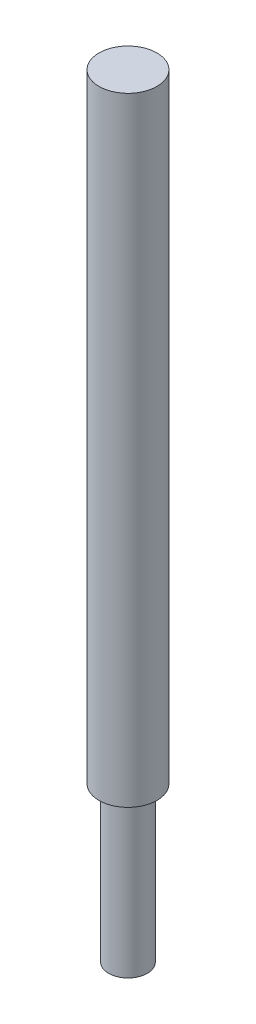
ISO-10303-21;
HEADER;
FILE_DESCRIPTION(('STEP AP214'),'2;1');
FILE_NAME('part.step','',(''),(''),'','','');
FILE_SCHEMA(('AUTOMOTIVE_DESIGN { 1 0 10303 214 1 1 1 1 }'));
ENDSEC;
DATA;
#1=APPLICATION_CONTEXT('core data for automotive mechanical design processes');
#2=APPLICATION_PROTOCOL_DEFINITION('international standard','automotive_design',2000,#1);
#3=PRODUCT_CONTEXT('',#1,'mechanical');
#4=PRODUCT('Part','Part','',(#3));
#5=PRODUCT_RELATED_PRODUCT_CATEGORY('part','',(#4));
#6=PRODUCT_DEFINITION_FORMATION('','',#4);
#7=PRODUCT_DEFINITION_CONTEXT('part definition',#1,'design');
#8=PRODUCT_DEFINITION('design','',#6,#7);
#9=PRODUCT_DEFINITION_SHAPE('','',#8);
#10=(LENGTH_UNIT() NAMED_UNIT(*) SI_UNIT(.MILLI.,.METRE.));
#11=(NAMED_UNIT(*) PLANE_ANGLE_UNIT() SI_UNIT($,.RADIAN.));
#12=(NAMED_UNIT(*) SI_UNIT($,.STERADIAN.) SOLID_ANGLE_UNIT());
#13=UNCERTAINTY_MEASURE_WITH_UNIT(LENGTH_MEASURE(1.E-05),#10,'distance_accuracy_value','');
#14=(GEOMETRIC_REPRESENTATION_CONTEXT(3) GLOBAL_UNCERTAINTY_ASSIGNED_CONTEXT((#13)) GLOBAL_UNIT_ASSIGNED_CONTEXT((#10,
#11,#12)) REPRESENTATION_CONTEXT('',''));
#15=CARTESIAN_POINT('',(0.,0.,0.));
#16=DIRECTION('',(0.,0.,1.));
#17=DIRECTION('',(1.,0.,0.));
#18=AXIS2_PLACEMENT_3D('',#15,#16,#17);
#19=CARTESIAN_POINT('',(0.,25.4,0.));
#20=DIRECTION('',(0.,-1.,0.));
#21=DIRECTION('',(0.,0.,-1.));
#22=AXIS2_PLACEMENT_3D('',#19,#20,#21);
#23=CYLINDRICAL_SURFACE('',#22,3.175);
#24=CARTESIAN_POINT('',(0.,25.4,0.));
#25=DIRECTION('',(0.,1.,0.));
#26=DIRECTION('',(0.,0.,1.));
#27=AXIS2_PLACEMENT_3D('',#24,#25,#26);
#28=CIRCLE('',#27,3.175);
#29=CARTESIAN_POINT('',(0.,25.4,3.175));
#30=VERTEX_POINT('',#29);
#31=EDGE_CURVE('E10',#30,#30,#28,.T.);
#32=ORIENTED_EDGE('',*,*,#31,.F.);
#33=EDGE_LOOP('',(#32));
#34=FACE_BOUND('',#33,.T.);
#35=CARTESIAN_POINT('',(0.,0.,0.));
#36=DIRECTION('',(0.,1.,0.));
#37=DIRECTION('',(0.,0.,1.));
#38=AXIS2_PLACEMENT_3D('',#35,#36,#37);
#39=CIRCLE('',#38,3.175);
#40=CARTESIAN_POINT('',(0.,0.,3.175));
#41=VERTEX_POINT('',#40);
#42=EDGE_CURVE('E36',#41,#41,#39,.T.);
#43=ORIENTED_EDGE('',*,*,#42,.T.);
#44=EDGE_LOOP('',(#43));
#45=FACE_BOUND('',#44,.T.);
#46=ADVANCED_FACE('F33',(#34,#45),#23,.T.);
#47=CARTESIAN_POINT('',(0.,0.,0.));
#48=DIRECTION('',(0.,1.,0.));
#49=DIRECTION('',(0.,0.,1.));
#50=AXIS2_PLACEMENT_3D('',#47,#48,#49);
#51=PLANE('',#50);
#52=ORIENTED_EDGE('',*,*,#42,.F.);
#53=EDGE_LOOP('',(#52));
#54=FACE_BOUND('',#53,.T.);
#55=ADVANCED_FACE('F56',(#54),#51,.F.);
#56=CARTESIAN_POINT('',(0.,127.,0.));
#57=DIRECTION('',(0.,-1.,0.));
#58=DIRECTION('',(0.,0.,-1.));
#59=AXIS2_PLACEMENT_3D('',#56,#57,#58);
#60=CYLINDRICAL_SURFACE('',#59,4.7625);
#61=CARTESIAN_POINT('',(0.,127.,0.));
#62=DIRECTION('',(0.,1.,0.));
#63=DIRECTION('',(0.,0.,1.));
#64=AXIS2_PLACEMENT_3D('',#61,#62,#63);
#65=CIRCLE('',#64,4.7625);
#66=CARTESIAN_POINT('',(0.,127.,4.7625));
#67=VERTEX_POINT('',#66);
#68=EDGE_CURVE('E43',#67,#67,#65,.T.);
#69=ORIENTED_EDGE('',*,*,#68,.F.);
#70=EDGE_LOOP('',(#69));
#71=FACE_BOUND('',#70,.T.);
#72=CARTESIAN_POINT('',(0.,25.4,0.));
#73=DIRECTION('',(0.,1.,0.));
#74=DIRECTION('',(0.,0.,1.));
#75=AXIS2_PLACEMENT_3D('',#72,#73,#74);
#76=CIRCLE('',#75,4.7625);
#77=CARTESIAN_POINT('',(0.,25.4,4.7625));
#78=VERTEX_POINT('',#77);
#79=EDGE_CURVE('E45',#78,#78,#76,.T.);
#80=ORIENTED_EDGE('',*,*,#79,.T.);
#81=EDGE_LOOP('',(#80));
#82=FACE_BOUND('',#81,.T.);
#83=ADVANCED_FACE('F53',(#71,#82),#60,.T.);
#84=CARTESIAN_POINT('',(0.,127.,0.));
#85=DIRECTION('',(0.,1.,0.));
#86=DIRECTION('',(0.,0.,1.));
#87=AXIS2_PLACEMENT_3D('',#84,#85,#86);
#88=PLANE('',#87);
#89=ORIENTED_EDGE('',*,*,#68,.T.);
#90=EDGE_LOOP('',(#89));
#91=FACE_BOUND('',#90,.T.);
#92=ADVANCED_FACE('F51',(#91),#88,.T.);
#93=CARTESIAN_POINT('',(0.,25.4,0.));
#94=DIRECTION('',(0.,1.,0.));
#95=DIRECTION('',(0.,0.,1.));
#96=AXIS2_PLACEMENT_3D('',#93,#94,#95);
#97=PLANE('',#96);
#98=ORIENTED_EDGE('',*,*,#31,.T.);
#99=EDGE_LOOP('',(#98));
#100=FACE_BOUND('',#99,.T.);
#101=ORIENTED_EDGE('',*,*,#79,.F.);
#102=EDGE_LOOP('',(#101));
#103=FACE_BOUND('',#102,.T.);
#104=ADVANCED_FACE('F60',(#100,#103),#97,.F.);
#105=CLOSED_SHELL('',(#46,#55,#83,#92,#104));
#106=MANIFOLD_SOLID_BREP('B2',#105);
#107=ADVANCED_BREP_SHAPE_REPRESENTATION('',(#18,#106),#14);
#108=SHAPE_DEFINITION_REPRESENTATION(#9,#107);
ENDSEC;
END-ISO-10303-21;
